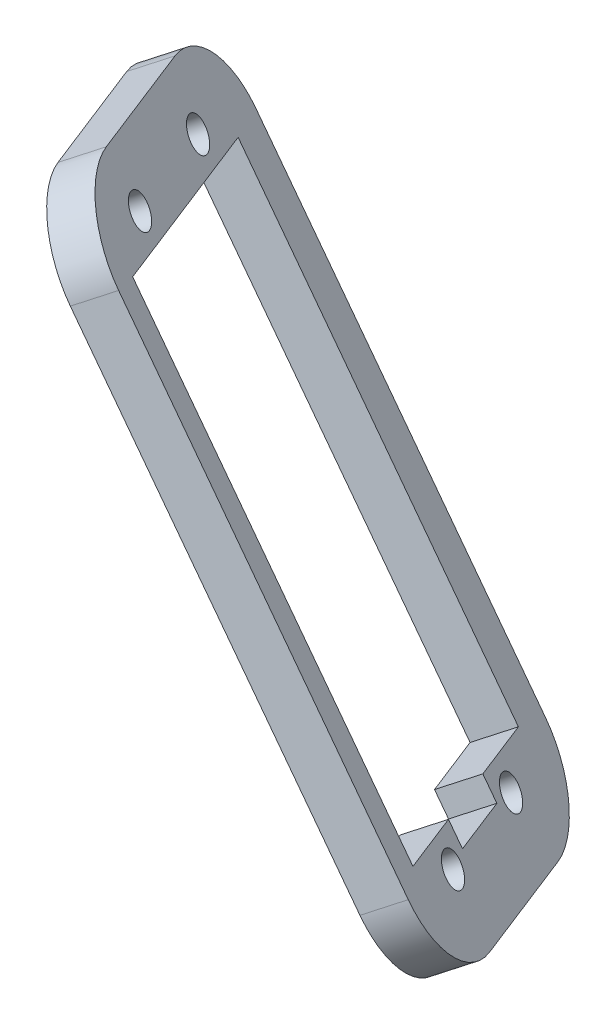
ISO-10303-21;
HEADER;
FILE_DESCRIPTION(('STEP AP214'),'2;1');
FILE_NAME('part.step','',(''),(''),'','','');
FILE_SCHEMA(('AUTOMOTIVE_DESIGN { 1 0 10303 214 1 1 1 1 }'));
ENDSEC;
DATA;
#1=APPLICATION_CONTEXT('core data for automotive mechanical design processes');
#2=APPLICATION_PROTOCOL_DEFINITION('international standard','automotive_design',2000,#1);
#3=PRODUCT_CONTEXT('',#1,'mechanical');
#4=PRODUCT('Part','Part','',(#3));
#5=PRODUCT_RELATED_PRODUCT_CATEGORY('part','',(#4));
#6=PRODUCT_DEFINITION_FORMATION('','',#4);
#7=PRODUCT_DEFINITION_CONTEXT('part definition',#1,'design');
#8=PRODUCT_DEFINITION('design','',#6,#7);
#9=PRODUCT_DEFINITION_SHAPE('','',#8);
#10=(LENGTH_UNIT() NAMED_UNIT(*) SI_UNIT(.MILLI.,.METRE.));
#11=(NAMED_UNIT(*) PLANE_ANGLE_UNIT() SI_UNIT($,.RADIAN.));
#12=(NAMED_UNIT(*) SI_UNIT($,.STERADIAN.) SOLID_ANGLE_UNIT());
#13=UNCERTAINTY_MEASURE_WITH_UNIT(LENGTH_MEASURE(1.E-05),#10,'distance_accuracy_value','');
#14=(GEOMETRIC_REPRESENTATION_CONTEXT(3) GLOBAL_UNCERTAINTY_ASSIGNED_CONTEXT((#13)) GLOBAL_UNIT_ASSIGNED_CONTEXT((#10,
#11,#12)) REPRESENTATION_CONTEXT('',''));
#15=CARTESIAN_POINT('',(0.,0.,0.));
#16=DIRECTION('',(0.,0.,1.));
#17=DIRECTION('',(1.,0.,0.));
#18=AXIS2_PLACEMENT_3D('',#15,#16,#17);
#19=CARTESIAN_POINT('',(-138.045703083911,-88.6474649306126,87.3415979869033));
#20=DIRECTION('',(-0.742744505062538,-0.476961006348122,0.469934887641673));
#21=DIRECTION('',(0.540342609409855,-0.841445104838188,0.));
#22=AXIS2_PLACEMENT_3D('',#19,#20,#21);
#23=PLANE('',#22);
#24=CARTESIAN_POINT('',(-338.360143592389,-143.155779393654,-284.583949763132));
#25=DIRECTION('',(-0.742744505062538,-0.476961006348123,0.469934887641673));
#26=DIRECTION('',(0.540342609409855,-0.841445104838188,0.));
#27=AXIS2_PLACEMENT_3D('',#24,#25,#26);
#28=CIRCLE('',#27,2.00000000000084);
#29=CARTESIAN_POINT('',(-337.279458373569,-144.838669603331,-284.583949763132));
#30=VERTEX_POINT('',#29);
#31=EDGE_CURVE('E255',#30,#30,#28,.T.);
#32=ORIENTED_EDGE('',*,*,#31,.F.);
#33=EDGE_LOOP('',(#32));
#34=FACE_BOUND('',#33,.T.);
#35=CARTESIAN_POINT('',(-345.918600174185,-146.010321717763,-299.42751140517));
#36=DIRECTION('',(-0.742744505062538,-0.476961006348123,0.469934887641673));
#37=DIRECTION('',(0.540342609409855,-0.841445104838188,0.));
#38=AXIS2_PLACEMENT_3D('',#35,#36,#37);
#39=CIRCLE('',#38,2.00000000000075);
#40=CARTESIAN_POINT('',(-344.837914955365,-147.69321192744,-299.42751140517));
#41=VERTEX_POINT('',#40);
#42=EDGE_CURVE('E251',#41,#41,#39,.T.);
#43=ORIENTED_EDGE('',*,*,#42,.F.);
#44=EDGE_LOOP('',(#43));
#45=FACE_BOUND('',#44,.T.);
#46=CARTESIAN_POINT('',(-304.974126351562,-200.946079477046,-290.470805381088));
#47=DIRECTION('',(-0.742744505062538,-0.476961006348123,0.469934887641673));
#48=DIRECTION('',(0.540342609409855,-0.841445104838188,0.));
#49=AXIS2_PLACEMENT_3D('',#46,#47,#48);
#50=CIRCLE('',#49,2.00000000000083);
#51=CARTESIAN_POINT('',(-303.893441132741,-202.628969686723,-290.470805381088));
#52=VERTEX_POINT('',#51);
#53=EDGE_CURVE('E247',#52,#52,#50,.T.);
#54=ORIENTED_EDGE('',*,*,#53,.F.);
#55=EDGE_LOOP('',(#54));
#56=FACE_BOUND('',#55,.T.);
#57=CARTESIAN_POINT('',(-312.532582933358,-203.800621801155,-305.314367023125));
#58=DIRECTION('',(-0.742744505062538,-0.476961006348123,0.469934887641673));
#59=DIRECTION('',(0.540342609409855,-0.841445104838188,0.));
#60=AXIS2_PLACEMENT_3D('',#57,#58,#59);
#61=CIRCLE('',#60,2.00000000000088);
#62=CARTESIAN_POINT('',(-311.451897714538,-205.483512010832,-305.314367023125));
#63=VERTEX_POINT('',#62);
#64=EDGE_CURVE('E243',#63,#63,#61,.T.);
#65=ORIENTED_EDGE('',*,*,#64,.F.);
#66=EDGE_LOOP('',(#65));
#67=FACE_BOUND('',#66,.T.);
#68=DIRECTION('',(0.447245951585577,0.168907829828928,0.878317256925306));
#69=VECTOR('',#68,1.);
#70=CARTESIAN_POINT('',(-314.054798329728,-212.986455291561,-317.043441947881));
#71=LINE('',#70,#69);
#72=CARTESIAN_POINT('',(-309.582338813872,-211.297376993272,-308.260269378628));
#73=VERTEX_POINT('',#72);
#74=CARTESIAN_POINT('',(-300.637419782161,-207.919220396693,-290.693924240122));
#75=VERTEX_POINT('',#74);
#76=EDGE_CURVE('E223',#73,#75,#71,.T.);
#77=ORIENTED_EDGE('',*,*,#76,.T.);
#78=CARTESIAN_POINT('',(-305.620407430045,-199.293802473799,-289.815289073263));
#79=DIRECTION('',(-0.742744505062538,-0.476961006348122,0.469934887641673));
#80=DIRECTION('',(0.540342609409855,-0.841445104838188,0.));
#81=AXIS2_PLACEMENT_3D('',#78,#79,#80);
#82=CIRCLE('',#81,10.);
#83=CARTESIAN_POINT('',(-301.14794791419,-197.60472417551,-281.03211650401));
#84=VERTEX_POINT('',#83);
#85=EDGE_CURVE('E278',#75,#84,#82,.T.);
#86=ORIENTED_EDGE('',*,*,#85,.T.);
#87=DIRECTION('',(-0.498298764788472,0.862541792289434,0.087863516685906));
#88=VECTOR('',#87,1.);
#89=CARTESIAN_POINT('',(-337.025458978959,-135.50171513067,-274.705943302625));
#90=LINE('',#89,#88);
#91=CARTESIAN_POINT('',(-332.042471331075,-144.127133053565,-275.584578469484));
#92=VERTEX_POINT('',#91);
#93=EDGE_CURVE('E227',#84,#92,#90,.T.);
#94=ORIENTED_EDGE('',*,*,#93,.T.);
#95=CARTESIAN_POINT('',(-336.51493084693,-145.816211351854,-284.367751038737));
#96=DIRECTION('',(-0.742744505062538,-0.476961006348122,0.469934887641673));
#97=DIRECTION('',(0.540342609409855,-0.841445104838188,0.));
#98=AXIS2_PLACEMENT_3D('',#95,#96,#97);
#99=CIRCLE('',#98,10.);
#100=CARTESIAN_POINT('',(-341.497918494815,-137.19079342896,-283.489115871878));
#101=VERTEX_POINT('',#100);
#102=EDGE_CURVE('E54',#92,#101,#99,.T.);
#103=ORIENTED_EDGE('',*,*,#102,.T.);
#104=DIRECTION('',(-0.447245951585578,-0.168907829828928,-0.878317256925305));
#105=VECTOR('',#104,1.);
#106=CARTESIAN_POINT('',(-354.915297042383,-142.258028323828,-309.838633579637));
#107=LINE('',#106,#105);
#108=CARTESIAN_POINT('',(-350.442837526527,-140.568950025538,-301.055461010384));
#109=VERTEX_POINT('',#108);
#110=EDGE_CURVE('E229',#101,#109,#107,.T.);
#111=ORIENTED_EDGE('',*,*,#110,.T.);
#112=CARTESIAN_POINT('',(-345.459849878642,-149.194367948433,-301.934096177243));
#113=DIRECTION('',(-0.742744505062538,-0.476961006348122,0.469934887641673));
#114=DIRECTION('',(0.540342609409855,-0.841445104838188,0.));
#115=AXIS2_PLACEMENT_3D('',#112,#113,#114);
#116=CIRCLE('',#115,10.);
#117=CARTESIAN_POINT('',(-349.932309394498,-150.883446246722,-310.717268746496));
#118=VERTEX_POINT('',#117);
#119=EDGE_CURVE('E273',#109,#118,#116,.T.);
#120=ORIENTED_EDGE('',*,*,#119,.T.);
#121=DIRECTION('',(0.498298764788472,-0.862541792289434,-0.087863516685906));
#122=VECTOR('',#121,1.);
#123=CARTESIAN_POINT('',(-354.915297042383,-142.258028323828,-309.838633579637));
#124=LINE('',#123,#122);
#125=CARTESIAN_POINT('',(-319.037785977613,-204.361037368667,-316.164806781022));
#126=VERTEX_POINT('',#125);
#127=EDGE_CURVE('E220',#118,#126,#124,.T.);
#128=ORIENTED_EDGE('',*,*,#127,.T.);
#129=CARTESIAN_POINT('',(-314.565326461757,-202.671959070377,-307.381634211769));
#130=DIRECTION('',(-0.742744505062538,-0.476961006348122,0.469934887641673));
#131=DIRECTION('',(0.540342609409855,-0.841445104838188,0.));
#132=AXIS2_PLACEMENT_3D('',#129,#130,#131);
#133=CIRCLE('',#132,10.);
#134=EDGE_CURVE('E276',#126,#73,#133,.T.);
#135=ORIENTED_EDGE('',*,*,#134,.T.);
#136=EDGE_LOOP('',(#77,#86,#94,#103,#111,#120,#128,#135));
#137=FACE_BOUND('',#136,.T.);
#138=DIRECTION('',(0.498298764788472,-0.862541792289434,-0.0878635166859052));
#139=VECTOR('',#138,1.);
#140=CARTESIAN_POINT('',(-317.362625676057,-201.947189553961,-311.067233787508));
#141=LINE('',#140,#139);
#142=CARTESIAN_POINT('',(-347.260551563365,-150.194682016595,-305.795422786354));
#143=VERTEX_POINT('',#142);
#144=CARTESIAN_POINT('',(-317.362625676057,-201.947189553961,-311.067233787508));
#145=VERTEX_POINT('',#144);
#146=EDGE_CURVE('E158',#143,#145,#141,.T.);
#147=ORIENTED_EDGE('',*,*,#146,.F.);
#148=DIRECTION('',(-0.447245951585576,-0.168907829828928,-0.878317256925306));
#149=VECTOR('',#148,1.);
#150=CARTESIAN_POINT('',(-347.260551563365,-150.194682016595,-305.795422786354));
#151=LINE('',#150,#149);
#152=CARTESIAN_POINT('',(-333.530100849688,-145.009211640847,-278.831082998747));
#153=VERTEX_POINT('',#152);
#154=EDGE_CURVE('E148',#153,#143,#151,.T.);
#155=ORIENTED_EDGE('',*,*,#154,.F.);
#156=DIRECTION('',(-0.498298764788472,0.862541792289434,0.0878635166859062));
#157=VECTOR('',#156,1.);
#158=CARTESIAN_POINT('',(-303.63217496238,-196.761719178213,-284.102893999901));
#159=LINE('',#158,#157);
#160=CARTESIAN_POINT('',(-303.63217496238,-196.761719178213,-284.102893999901));
#161=VERTEX_POINT('',#160);
#162=EDGE_CURVE('E185',#161,#153,#159,.T.);
#163=ORIENTED_EDGE('',*,*,#162,.F.);
#164=DIRECTION('',(0.447245951585577,0.168907829828926,0.878317256925306));
#165=VECTOR('',#164,1.);
#166=CARTESIAN_POINT('',(-308.261170561291,-198.509915216943,-293.193477609078));
#167=LINE('',#166,#165);
#168=CARTESIAN_POINT('',(-308.261170561291,-198.509915216943,-293.193477609078));
#169=VERTEX_POINT('',#168);
#170=EDGE_CURVE('E182',#169,#161,#167,.T.);
#171=ORIENTED_EDGE('',*,*,#170,.F.);
#172=DIRECTION('',(-0.498298764788479,0.862541792289428,0.0878635166859187));
#173=VECTOR('',#172,1.);
#174=CARTESIAN_POINT('',(-308.261170561291,-198.509915216943,-293.193477609078));
#175=LINE('',#174,#173);
#176=CARTESIAN_POINT('',(-306.766274266925,-201.097540593811,-293.457068159136));
#177=VERTEX_POINT('',#176);
#178=EDGE_CURVE('E180',#177,#169,#175,.T.);
#179=ORIENTED_EDGE('',*,*,#178,.F.);
#180=DIRECTION('',(0.447245951585579,0.168907829828929,0.878317256925305));
#181=VECTOR('',#180,1.);
#182=CARTESIAN_POINT('',(-311.238733782781,-202.7866188921,-302.240240728389));
#183=LINE('',#182,#181);
#184=CARTESIAN_POINT('',(-311.238733782781,-202.7866188921,-302.240240728389));
#185=VERTEX_POINT('',#184);
#186=EDGE_CURVE('E178',#185,#177,#183,.T.);
#187=ORIENTED_EDGE('',*,*,#186,.F.);
#188=DIRECTION('',(0.498298764788466,-0.862541792289438,-0.0878635166859012));
#189=VECTOR('',#188,1.);
#190=CARTESIAN_POINT('',(-312.733630077146,-200.198993515232,-301.976650178331));
#191=LINE('',#190,#189);
#192=CARTESIAN_POINT('',(-312.733630077146,-200.198993515232,-301.976650178331));
#193=VERTEX_POINT('',#192);
#194=EDGE_CURVE('E173',#193,#185,#191,.T.);
#195=ORIENTED_EDGE('',*,*,#194,.F.);
#196=DIRECTION('',(0.447245951585579,0.16890782982893,0.878317256925304));
#197=VECTOR('',#196,1.);
#198=CARTESIAN_POINT('',(-317.362625676057,-201.947189553961,-311.067233787508));
#199=LINE('',#198,#197);
#200=EDGE_CURVE('E171',#145,#193,#199,.T.);
#201=ORIENTED_EDGE('',*,*,#200,.F.);
#202=EDGE_LOOP('',(#147,#155,#163,#171,#179,#187,#195,#201));
#203=FACE_BOUND('',#202,.T.);
#204=ADVANCED_FACE('F33',(#34,#45,#56,#67,#137,#203),#23,.T.);
#205=CARTESIAN_POINT('',(-134.331980558599,-86.2626598988719,84.991923548695));
#206=DIRECTION('',(-0.742744505062538,-0.476961006348122,0.469934887641673));
#207=DIRECTION('',(0.540342609409855,-0.841445104838188,0.));
#208=AXIS2_PLACEMENT_3D('',#205,#206,#207);
#209=PLANE('',#208);
#210=CARTESIAN_POINT('',(-334.646421067076,-140.770974361913,-286.93362420134));
#211=DIRECTION('',(-0.742744505062538,-0.476961006348122,0.469934887641673));
#212=DIRECTION('',(0.540342609409855,-0.841445104838188,0.));
#213=AXIS2_PLACEMENT_3D('',#210,#211,#212);
#214=CIRCLE('',#213,2.00000000000084);
#215=CARTESIAN_POINT('',(-333.565735848256,-142.45386457159,-286.93362420134));
#216=VERTEX_POINT('',#215);
#217=EDGE_CURVE('E252',#216,#216,#214,.T.);
#218=ORIENTED_EDGE('',*,*,#217,.T.);
#219=EDGE_LOOP('',(#218));
#220=FACE_BOUND('',#219,.T.);
#221=CARTESIAN_POINT('',(-342.204877648873,-143.625516686022,-301.777185843378));
#222=DIRECTION('',(-0.742744505062538,-0.476961006348122,0.469934887641673));
#223=DIRECTION('',(0.540342609409855,-0.841445104838188,0.));
#224=AXIS2_PLACEMENT_3D('',#221,#222,#223);
#225=CIRCLE('',#224,2.00000000000075);
#226=CARTESIAN_POINT('',(-341.124192430053,-145.308406895699,-301.777185843378));
#227=VERTEX_POINT('',#226);
#228=EDGE_CURVE('E248',#227,#227,#225,.T.);
#229=ORIENTED_EDGE('',*,*,#228,.T.);
#230=EDGE_LOOP('',(#229));
#231=FACE_BOUND('',#230,.T.);
#232=CARTESIAN_POINT('',(-301.260403826249,-198.561274445305,-292.820479819296));
#233=DIRECTION('',(-0.742744505062538,-0.476961006348122,0.469934887641673));
#234=DIRECTION('',(0.540342609409855,-0.841445104838188,0.));
#235=AXIS2_PLACEMENT_3D('',#232,#233,#234);
#236=CIRCLE('',#235,2.00000000000083);
#237=CARTESIAN_POINT('',(-300.179718607429,-200.244164654982,-292.820479819296));
#238=VERTEX_POINT('',#237);
#239=EDGE_CURVE('E244',#238,#238,#236,.T.);
#240=ORIENTED_EDGE('',*,*,#239,.T.);
#241=EDGE_LOOP('',(#240));
#242=FACE_BOUND('',#241,.T.);
#243=CARTESIAN_POINT('',(-308.818860408045,-201.415816769414,-307.664041461334));
#244=DIRECTION('',(-0.742744505062538,-0.476961006348122,0.469934887641673));
#245=DIRECTION('',(0.540342609409855,-0.841445104838188,0.));
#246=AXIS2_PLACEMENT_3D('',#243,#244,#245);
#247=CIRCLE('',#246,2.00000000000088);
#248=CARTESIAN_POINT('',(-307.738175189225,-203.098706979091,-307.664041461334));
#249=VERTEX_POINT('',#248);
#250=EDGE_CURVE('E189',#249,#249,#247,.T.);
#251=ORIENTED_EDGE('',*,*,#250,.T.);
#252=EDGE_LOOP('',(#251));
#253=FACE_BOUND('',#252,.T.);
#254=DIRECTION('',(-0.498298764788472,0.862541792289434,0.087863516685906));
#255=VECTOR('',#254,1.);
#256=CARTESIAN_POINT('',(-333.311736453647,-133.11691009893,-277.055617740833));
#257=LINE('',#256,#255);
#258=CARTESIAN_POINT('',(-297.434225388877,-195.219919143769,-283.381790942218));
#259=VERTEX_POINT('',#258);
#260=CARTESIAN_POINT('',(-328.328748805762,-141.742328021824,-277.934252907692));
#261=VERTEX_POINT('',#260);
#262=EDGE_CURVE('E237',#259,#261,#257,.T.);
#263=ORIENTED_EDGE('',*,*,#262,.F.);
#264=CARTESIAN_POINT('',(-301.906684904733,-196.908997442058,-292.164963511471));
#265=DIRECTION('',(-0.742744505062538,-0.476961006348122,0.469934887641673));
#266=DIRECTION('',(0.540342609409855,-0.841445104838188,0.));
#267=AXIS2_PLACEMENT_3D('',#264,#265,#266);
#268=CIRCLE('',#267,10.);
#269=CARTESIAN_POINT('',(-296.923697256848,-205.534415364953,-293.04359867833));
#270=VERTEX_POINT('',#269);
#271=EDGE_CURVE('E266',#259,#270,#268,.F.);
#272=ORIENTED_EDGE('',*,*,#271,.T.);
#273=DIRECTION('',(0.447245951585577,0.168907829828928,0.878317256925306));
#274=VECTOR('',#273,1.);
#275=CARTESIAN_POINT('',(-310.341075804415,-210.60165025982,-319.39311638609));
#276=LINE('',#275,#274);
#277=CARTESIAN_POINT('',(-305.868616288559,-208.912571961531,-310.609943816837));
#278=VERTEX_POINT('',#277);
#279=EDGE_CURVE('E234',#278,#270,#276,.T.);
#280=ORIENTED_EDGE('',*,*,#279,.F.);
#281=CARTESIAN_POINT('',(-310.851603936444,-200.287154038637,-309.731308649978));
#282=DIRECTION('',(-0.742744505062538,-0.476961006348122,0.469934887641673));
#283=DIRECTION('',(0.540342609409855,-0.841445104838188,0.));
#284=AXIS2_PLACEMENT_3D('',#281,#282,#283);
#285=CIRCLE('',#284,10.);
#286=CARTESIAN_POINT('',(-315.3240634523,-201.976232336926,-318.514481219231));
#287=VERTEX_POINT('',#286);
#288=EDGE_CURVE('E264',#278,#287,#285,.F.);
#289=ORIENTED_EDGE('',*,*,#288,.T.);
#290=DIRECTION('',(0.498298764788472,-0.862541792289434,-0.087863516685906));
#291=VECTOR('',#290,1.);
#292=CARTESIAN_POINT('',(-351.20157451707,-139.873223292087,-312.188308017845));
#293=LINE('',#292,#291);
#294=CARTESIAN_POINT('',(-346.218586869185,-148.498641214981,-313.066943184704));
#295=VERTEX_POINT('',#294);
#296=EDGE_CURVE('E166',#295,#287,#293,.T.);
#297=ORIENTED_EDGE('',*,*,#296,.F.);
#298=CARTESIAN_POINT('',(-341.746127353329,-146.809562916692,-304.283770615451));
#299=DIRECTION('',(-0.742744505062538,-0.476961006348122,0.469934887641673));
#300=DIRECTION('',(0.540342609409855,-0.841445104838188,0.));
#301=AXIS2_PLACEMENT_3D('',#298,#299,#300);
#302=CIRCLE('',#301,10.);
#303=CARTESIAN_POINT('',(-346.729115001214,-138.184144993798,-303.405135448592));
#304=VERTEX_POINT('',#303);
#305=EDGE_CURVE('E260',#295,#304,#302,.F.);
#306=ORIENTED_EDGE('',*,*,#305,.T.);
#307=DIRECTION('',(-0.447245951585578,-0.168907829828928,-0.878317256925305));
#308=VECTOR('',#307,1.);
#309=CARTESIAN_POINT('',(-351.20157451707,-139.873223292087,-312.188308017845));
#310=LINE('',#309,#308);
#311=CARTESIAN_POINT('',(-337.784195969502,-134.805988397219,-285.838790310086));
#312=VERTEX_POINT('',#311);
#313=EDGE_CURVE('E224',#312,#304,#310,.T.);
#314=ORIENTED_EDGE('',*,*,#313,.F.);
#315=CARTESIAN_POINT('',(-332.801208321618,-143.431406320113,-286.717425476945));
#316=DIRECTION('',(-0.742744505062538,-0.476961006348122,0.469934887641673));
#317=DIRECTION('',(0.540342609409855,-0.841445104838188,0.));
#318=AXIS2_PLACEMENT_3D('',#315,#316,#317);
#319=CIRCLE('',#318,10.);
#320=EDGE_CURVE('E262',#312,#261,#319,.F.);
#321=ORIENTED_EDGE('',*,*,#320,.T.);
#322=EDGE_LOOP('',(#263,#272,#280,#289,#297,#306,#314,#321));
#323=FACE_BOUND('',#322,.T.);
#324=DIRECTION('',(-0.447245951585576,-0.168907829828928,-0.878317256925306));
#325=VECTOR('',#324,1.);
#326=CARTESIAN_POINT('',(-343.546829038053,-147.809876984855,-308.145097224562));
#327=LINE('',#326,#325);
#328=CARTESIAN_POINT('',(-329.816378324376,-142.624406609107,-281.180757436955));
#329=VERTEX_POINT('',#328);
#330=CARTESIAN_POINT('',(-343.546829038053,-147.809876984855,-308.145097224562));
#331=VERTEX_POINT('',#330);
#332=EDGE_CURVE('E187',#329,#331,#327,.T.);
#333=ORIENTED_EDGE('',*,*,#332,.T.);
#334=DIRECTION('',(0.498298764788472,-0.862541792289434,-0.0878635166859052));
#335=VECTOR('',#334,1.);
#336=CARTESIAN_POINT('',(-313.648903150744,-199.562384522221,-313.416908225717));
#337=LINE('',#336,#335);
#338=CARTESIAN_POINT('',(-313.648903150744,-199.562384522221,-313.416908225717));
#339=VERTEX_POINT('',#338);
#340=EDGE_CURVE('E165',#331,#339,#337,.T.);
#341=ORIENTED_EDGE('',*,*,#340,.T.);
#342=DIRECTION('',(0.447245951585579,0.16890782982893,0.878317256925304));
#343=VECTOR('',#342,1.);
#344=CARTESIAN_POINT('',(-313.648903150744,-199.562384522221,-313.416908225717));
#345=LINE('',#344,#343);
#346=CARTESIAN_POINT('',(-309.019907551834,-197.814188483491,-304.32632461654));
#347=VERTEX_POINT('',#346);
#348=EDGE_CURVE('E191',#339,#347,#345,.T.);
#349=ORIENTED_EDGE('',*,*,#348,.T.);
#350=DIRECTION('',(0.498298764788466,-0.862541792289438,-0.0878635166859012));
#351=VECTOR('',#350,1.);
#352=CARTESIAN_POINT('',(-309.019907551834,-197.814188483491,-304.32632461654));
#353=LINE('',#352,#351);
#354=CARTESIAN_POINT('',(-307.525011257468,-200.40181386036,-304.589915166597));
#355=VERTEX_POINT('',#354);
#356=EDGE_CURVE('E194',#347,#355,#353,.T.);
#357=ORIENTED_EDGE('',*,*,#356,.T.);
#358=DIRECTION('',(0.447245951585579,0.168907829828929,0.878317256925305));
#359=VECTOR('',#358,1.);
#360=CARTESIAN_POINT('',(-307.525011257468,-200.40181386036,-304.589915166597));
#361=LINE('',#360,#359);
#362=CARTESIAN_POINT('',(-303.052551741613,-198.71273556207,-295.806742597344));
#363=VERTEX_POINT('',#362);
#364=EDGE_CURVE('E197',#355,#363,#361,.T.);
#365=ORIENTED_EDGE('',*,*,#364,.T.);
#366=DIRECTION('',(-0.498298764788479,0.862541792289428,0.0878635166859187));
#367=VECTOR('',#366,1.);
#368=CARTESIAN_POINT('',(-304.547448035978,-196.125110185202,-295.543152047287));
#369=LINE('',#368,#367);
#370=CARTESIAN_POINT('',(-304.547448035978,-196.125110185202,-295.543152047287));
#371=VERTEX_POINT('',#370);
#372=EDGE_CURVE('E200',#363,#371,#369,.T.);
#373=ORIENTED_EDGE('',*,*,#372,.T.);
#374=DIRECTION('',(0.447245951585577,0.168907829828926,0.878317256925306));
#375=VECTOR('',#374,1.);
#376=CARTESIAN_POINT('',(-304.547448035978,-196.125110185202,-295.543152047287));
#377=LINE('',#376,#375);
#378=CARTESIAN_POINT('',(-299.918452437067,-194.376914146473,-286.45256843811));
#379=VERTEX_POINT('',#378);
#380=EDGE_CURVE('E203',#371,#379,#377,.T.);
#381=ORIENTED_EDGE('',*,*,#380,.T.);
#382=DIRECTION('',(-0.498298764788472,0.862541792289434,0.0878635166859062));
#383=VECTOR('',#382,1.);
#384=CARTESIAN_POINT('',(-299.918452437067,-194.376914146473,-286.45256843811));
#385=LINE('',#384,#383);
#386=EDGE_CURVE('E159',#379,#329,#385,.T.);
#387=ORIENTED_EDGE('',*,*,#386,.T.);
#388=EDGE_LOOP('',(#333,#341,#349,#357,#365,#373,#381,#387));
#389=FACE_BOUND('',#388,.T.);
#390=ADVANCED_FACE('F302',(#220,#231,#242,#253,#323,#389),#209,.F.);
#391=CARTESIAN_POINT('',(-354.915297042383,-142.258028323828,-309.838633579637));
#392=DIRECTION('',(0.447245951585577,0.168907829828928,0.878317256925306));
#393=DIRECTION('',(0.891121016780283,0.,-0.453765725294976));
#394=AXIS2_PLACEMENT_3D('',#391,#392,#393);
#395=PLANE('',#394);
#396=ORIENTED_EDGE('',*,*,#296,.T.);
#397=DIRECTION('',(0.742744505062538,0.476961006348122,-0.469934887641673));
#398=VECTOR('',#397,1.);
#399=CARTESIAN_POINT('',(-319.037785977613,-204.361037368667,-316.164806781022));
#400=LINE('',#399,#398);
#401=EDGE_CURVE('E283',#287,#126,#400,.F.);
#402=ORIENTED_EDGE('',*,*,#401,.T.);
#403=ORIENTED_EDGE('',*,*,#127,.F.);
#404=DIRECTION('',(0.742744505062538,0.476961006348122,-0.469934887641673));
#405=VECTOR('',#404,1.);
#406=CARTESIAN_POINT('',(-349.932309394498,-150.883446246722,-310.717268746496));
#407=LINE('',#406,#405);
#408=EDGE_CURVE('E280',#118,#295,#407,.T.);
#409=ORIENTED_EDGE('',*,*,#408,.T.);
#410=EDGE_LOOP('',(#396,#402,#403,#409));
#411=FACE_BOUND('',#410,.T.);
#412=ADVANCED_FACE('F287',(#411),#395,.F.);
#413=CARTESIAN_POINT('',(-314.054798329728,-212.986455291561,-317.043441947881));
#414=DIRECTION('',(-0.498298764788472,0.862541792289434,0.087863516685906));
#415=DIRECTION('',(-0.865890604697365,-0.500233406218369,0.));
#416=AXIS2_PLACEMENT_3D('',#413,#414,#415);
#417=PLANE('',#416);
#418=ORIENTED_EDGE('',*,*,#279,.T.);
#419=DIRECTION('',(0.742744505062538,0.476961006348122,-0.469934887641673));
#420=VECTOR('',#419,1.);
#421=CARTESIAN_POINT('',(-300.637419782161,-207.919220396693,-290.693924240122));
#422=LINE('',#421,#420);
#423=EDGE_CURVE('E271',#270,#75,#422,.F.);
#424=ORIENTED_EDGE('',*,*,#423,.T.);
#425=ORIENTED_EDGE('',*,*,#76,.F.);
#426=DIRECTION('',(0.742744505062538,0.476961006348122,-0.469934887641673));
#427=VECTOR('',#426,1.);
#428=CARTESIAN_POINT('',(-309.582338813872,-211.297376993272,-308.260269378628));
#429=LINE('',#428,#427);
#430=EDGE_CURVE('E268',#73,#278,#429,.T.);
#431=ORIENTED_EDGE('',*,*,#430,.T.);
#432=EDGE_LOOP('',(#418,#424,#425,#431));
#433=FACE_BOUND('',#432,.T.);
#434=ADVANCED_FACE('F298',(#433),#417,.F.);
#435=CARTESIAN_POINT('',(-337.025458978959,-135.50171513067,-274.705943302625));
#436=DIRECTION('',(-0.447245951585578,-0.168907829828928,-0.878317256925306));
#437=DIRECTION('',(-0.891121016780283,0.,0.453765725294976));
#438=AXIS2_PLACEMENT_3D('',#435,#436,#437);
#439=PLANE('',#438);
#440=ORIENTED_EDGE('',*,*,#93,.F.);
#441=DIRECTION('',(0.742744505062538,0.476961006348122,-0.469934887641673));
#442=VECTOR('',#441,1.);
#443=CARTESIAN_POINT('',(-301.14794791419,-197.60472417551,-281.03211650401));
#444=LINE('',#443,#442);
#445=EDGE_CURVE('E257',#84,#259,#444,.T.);
#446=ORIENTED_EDGE('',*,*,#445,.T.);
#447=ORIENTED_EDGE('',*,*,#262,.T.);
#448=DIRECTION('',(0.742744505062538,0.476961006348122,-0.469934887641673));
#449=VECTOR('',#448,1.);
#450=CARTESIAN_POINT('',(-332.042471331075,-144.127133053565,-275.584578469484));
#451=LINE('',#450,#449);
#452=EDGE_CURVE('E231',#261,#92,#451,.F.);
#453=ORIENTED_EDGE('',*,*,#452,.T.);
#454=EDGE_LOOP('',(#440,#446,#447,#453));
#455=FACE_BOUND('',#454,.T.);
#456=ADVANCED_FACE('F310',(#455),#439,.F.);
#457=CARTESIAN_POINT('',(-354.915297042383,-142.258028323828,-309.838633579637));
#458=DIRECTION('',(0.498298764788472,-0.862541792289434,-0.0878635166859066));
#459=DIRECTION('',(0.865890604697365,0.500233406218369,0.));
#460=AXIS2_PLACEMENT_3D('',#457,#458,#459);
#461=PLANE('',#460);
#462=ORIENTED_EDGE('',*,*,#110,.F.);
#463=DIRECTION('',(0.742744505062538,0.476961006348122,-0.469934887641673));
#464=VECTOR('',#463,1.);
#465=CARTESIAN_POINT('',(-341.497918494815,-137.19079342896,-283.489115871878));
#466=LINE('',#465,#464);
#467=EDGE_CURVE('E11',#101,#312,#466,.T.);
#468=ORIENTED_EDGE('',*,*,#467,.T.);
#469=ORIENTED_EDGE('',*,*,#313,.T.);
#470=DIRECTION('',(0.742744505062538,0.476961006348122,-0.469934887641673));
#471=VECTOR('',#470,1.);
#472=CARTESIAN_POINT('',(-350.442837526527,-140.568950025538,-301.055461010384));
#473=LINE('',#472,#471);
#474=EDGE_CURVE('E41',#304,#109,#473,.F.);
#475=ORIENTED_EDGE('',*,*,#474,.T.);
#476=EDGE_LOOP('',(#462,#468,#469,#475));
#477=FACE_BOUND('',#476,.T.);
#478=ADVANCED_FACE('F316',(#477),#461,.F.);
#479=CARTESIAN_POINT('',(-347.260551563365,-150.194682016595,-305.795422786354));
#480=DIRECTION('',(0.498298764788473,-0.862541792289434,-0.0878635166859051));
#481=DIRECTION('',(0.865890604697365,0.500233406218369,0.));
#482=AXIS2_PLACEMENT_3D('',#479,#480,#481);
#483=PLANE('',#482);
#484=ORIENTED_EDGE('',*,*,#332,.F.);
#485=DIRECTION('',(0.742744505062538,0.476961006348122,-0.469934887641673));
#486=VECTOR('',#485,1.);
#487=CARTESIAN_POINT('',(-333.530100849688,-145.009211640847,-278.831082998747));
#488=LINE('',#487,#486);
#489=EDGE_CURVE('E154',#153,#329,#488,.T.);
#490=ORIENTED_EDGE('',*,*,#489,.F.);
#491=ORIENTED_EDGE('',*,*,#154,.T.);
#492=DIRECTION('',(0.742744505062538,0.476961006348122,-0.469934887641673));
#493=VECTOR('',#492,1.);
#494=CARTESIAN_POINT('',(-347.260551563365,-150.194682016595,-305.795422786354));
#495=LINE('',#494,#493);
#496=EDGE_CURVE('E151',#143,#331,#495,.T.);
#497=ORIENTED_EDGE('',*,*,#496,.T.);
#498=EDGE_LOOP('',(#484,#490,#491,#497));
#499=FACE_BOUND('',#498,.T.);
#500=ADVANCED_FACE('F150',(#499),#483,.T.);
#501=CARTESIAN_POINT('',(-317.362625676057,-201.947189553961,-311.067233787508));
#502=DIRECTION('',(0.447245951585577,0.168907829828929,0.878317256925306));
#503=DIRECTION('',(0.891121016780283,0.,-0.453765725294975));
#504=AXIS2_PLACEMENT_3D('',#501,#502,#503);
#505=PLANE('',#504);
#506=ORIENTED_EDGE('',*,*,#340,.F.);
#507=ORIENTED_EDGE('',*,*,#496,.F.);
#508=ORIENTED_EDGE('',*,*,#146,.T.);
#509=DIRECTION('',(0.742744505062538,0.476961006348122,-0.469934887641673));
#510=VECTOR('',#509,1.);
#511=CARTESIAN_POINT('',(-317.362625676057,-201.947189553961,-311.067233787508));
#512=LINE('',#511,#510);
#513=EDGE_CURVE('E167',#145,#339,#512,.T.);
#514=ORIENTED_EDGE('',*,*,#513,.T.);
#515=EDGE_LOOP('',(#506,#507,#508,#514));
#516=FACE_BOUND('',#515,.T.);
#517=ADVANCED_FACE('F162',(#516),#505,.T.);
#518=CARTESIAN_POINT('',(-317.362625676057,-201.947189553961,-311.067233787508));
#519=DIRECTION('',(-0.498298764788472,0.862541792289434,0.0878635166859055));
#520=DIRECTION('',(-0.865890604697365,-0.500233406218369,0.));
#521=AXIS2_PLACEMENT_3D('',#518,#519,#520);
#522=PLANE('',#521);
#523=ORIENTED_EDGE('',*,*,#348,.F.);
#524=ORIENTED_EDGE('',*,*,#513,.F.);
#525=ORIENTED_EDGE('',*,*,#200,.T.);
#526=DIRECTION('',(0.742744505062538,0.476961006348122,-0.469934887641673));
#527=VECTOR('',#526,1.);
#528=CARTESIAN_POINT('',(-312.733630077146,-200.198993515232,-301.976650178331));
#529=LINE('',#528,#527);
#530=EDGE_CURVE('E217',#193,#347,#529,.T.);
#531=ORIENTED_EDGE('',*,*,#530,.T.);
#532=EDGE_LOOP('',(#523,#524,#525,#531));
#533=FACE_BOUND('',#532,.T.);
#534=ADVANCED_FACE('F447',(#533),#522,.T.);
#535=CARTESIAN_POINT('',(-312.733630077146,-200.198993515232,-301.976650178331));
#536=DIRECTION('',(0.447245951585577,0.168907829828929,0.878317256925306));
#537=DIRECTION('',(0.891121016780283,0.,-0.453765725294975));
#538=AXIS2_PLACEMENT_3D('',#535,#536,#537);
#539=PLANE('',#538);
#540=ORIENTED_EDGE('',*,*,#356,.F.);
#541=ORIENTED_EDGE('',*,*,#530,.F.);
#542=ORIENTED_EDGE('',*,*,#194,.T.);
#543=DIRECTION('',(0.742744505062538,0.476961006348122,-0.469934887641673));
#544=VECTOR('',#543,1.);
#545=CARTESIAN_POINT('',(-311.238733782781,-202.7866188921,-302.240240728389));
#546=LINE('',#545,#544);
#547=EDGE_CURVE('E215',#185,#355,#546,.T.);
#548=ORIENTED_EDGE('',*,*,#547,.T.);
#549=EDGE_LOOP('',(#540,#541,#542,#548));
#550=FACE_BOUND('',#549,.T.);
#551=ADVANCED_FACE('F438',(#550),#539,.T.);
#552=CARTESIAN_POINT('',(-311.238733782781,-202.7866188921,-302.240240728389));
#553=DIRECTION('',(-0.498298764788472,0.862541792289434,0.0878635166859058));
#554=DIRECTION('',(-0.865890604697365,-0.500233406218369,0.));
#555=AXIS2_PLACEMENT_3D('',#552,#553,#554);
#556=PLANE('',#555);
#557=ORIENTED_EDGE('',*,*,#364,.F.);
#558=ORIENTED_EDGE('',*,*,#547,.F.);
#559=ORIENTED_EDGE('',*,*,#186,.T.);
#560=DIRECTION('',(0.742744505062538,0.476961006348122,-0.469934887641673));
#561=VECTOR('',#560,1.);
#562=CARTESIAN_POINT('',(-306.766274266925,-201.097540593811,-293.457068159136));
#563=LINE('',#562,#561);
#564=EDGE_CURVE('E213',#177,#363,#563,.T.);
#565=ORIENTED_EDGE('',*,*,#564,.T.);
#566=EDGE_LOOP('',(#557,#558,#559,#565));
#567=FACE_BOUND('',#566,.T.);
#568=ADVANCED_FACE('F429',(#567),#556,.T.);
#569=CARTESIAN_POINT('',(-308.261170561291,-198.509915216943,-293.193477609078));
#570=DIRECTION('',(-0.447245951585581,-0.168907829828922,-0.878317256925305));
#571=DIRECTION('',(-0.891121016780281,0.,0.453765725294979));
#572=AXIS2_PLACEMENT_3D('',#569,#570,#571);
#573=PLANE('',#572);
#574=ORIENTED_EDGE('',*,*,#372,.F.);
#575=ORIENTED_EDGE('',*,*,#564,.F.);
#576=ORIENTED_EDGE('',*,*,#178,.T.);
#577=DIRECTION('',(0.742744505062538,0.476961006348122,-0.469934887641673));
#578=VECTOR('',#577,1.);
#579=CARTESIAN_POINT('',(-308.261170561291,-198.509915216943,-293.193477609078));
#580=LINE('',#579,#578);
#581=EDGE_CURVE('E211',#169,#371,#580,.T.);
#582=ORIENTED_EDGE('',*,*,#581,.T.);
#583=EDGE_LOOP('',(#574,#575,#576,#582));
#584=FACE_BOUND('',#583,.T.);
#585=ADVANCED_FACE('F420',(#584),#573,.T.);
#586=CARTESIAN_POINT('',(-308.261170561291,-198.509915216943,-293.193477609078));
#587=DIRECTION('',(-0.498298764788472,0.862541792289434,0.0878635166859071));
#588=DIRECTION('',(-0.865890604697365,-0.500233406218368,0.));
#589=AXIS2_PLACEMENT_3D('',#586,#587,#588);
#590=PLANE('',#589);
#591=ORIENTED_EDGE('',*,*,#380,.F.);
#592=ORIENTED_EDGE('',*,*,#581,.F.);
#593=ORIENTED_EDGE('',*,*,#170,.T.);
#594=DIRECTION('',(0.742744505062538,0.476961006348122,-0.469934887641673));
#595=VECTOR('',#594,1.);
#596=CARTESIAN_POINT('',(-303.63217496238,-196.761719178213,-284.102893999901));
#597=LINE('',#596,#595);
#598=EDGE_CURVE('E209',#161,#379,#597,.T.);
#599=ORIENTED_EDGE('',*,*,#598,.T.);
#600=EDGE_LOOP('',(#591,#592,#593,#599));
#601=FACE_BOUND('',#600,.T.);
#602=ADVANCED_FACE('F411',(#601),#590,.T.);
#603=CARTESIAN_POINT('',(-303.63217496238,-196.761719178213,-284.102893999901));
#604=DIRECTION('',(-0.447245951585577,-0.168907829828928,-0.878317256925306));
#605=DIRECTION('',(-0.891121016780283,0.,0.453765725294976));
#606=AXIS2_PLACEMENT_3D('',#603,#604,#605);
#607=PLANE('',#606);
#608=ORIENTED_EDGE('',*,*,#386,.F.);
#609=ORIENTED_EDGE('',*,*,#598,.F.);
#610=ORIENTED_EDGE('',*,*,#162,.T.);
#611=ORIENTED_EDGE('',*,*,#489,.T.);
#612=EDGE_LOOP('',(#608,#609,#610,#611));
#613=FACE_BOUND('',#612,.T.);
#614=ADVANCED_FACE('F402',(#613),#607,.T.);
#615=CARTESIAN_POINT('',(-305.105137882732,-199.031011737673,-310.013715899542));
#616=DIRECTION('',(-0.742744505062538,-0.476961006348123,0.469934887641673));
#617=DIRECTION('',(0.540342609409856,-0.841445104838188,0.));
#618=AXIS2_PLACEMENT_3D('',#615,#616,#617);
#619=CYLINDRICAL_SURFACE('',#618,2.00000000000088);
#620=ORIENTED_EDGE('',*,*,#64,.T.);
#621=EDGE_LOOP('',(#620));
#622=FACE_BOUND('',#621,.T.);
#623=ORIENTED_EDGE('',*,*,#250,.F.);
#624=EDGE_LOOP('',(#623));
#625=FACE_BOUND('',#624,.T.);
#626=ADVANCED_FACE('F393',(#622,#625),#619,.F.);
#627=CARTESIAN_POINT('',(-297.546681300936,-196.176469413565,-295.170154257504));
#628=DIRECTION('',(-0.742744505062538,-0.476961006348123,0.469934887641673));
#629=DIRECTION('',(0.540342609409856,-0.841445104838188,0.));
#630=AXIS2_PLACEMENT_3D('',#627,#628,#629);
#631=CYLINDRICAL_SURFACE('',#630,2.00000000000083);
#632=ORIENTED_EDGE('',*,*,#53,.T.);
#633=EDGE_LOOP('',(#632));
#634=FACE_BOUND('',#633,.T.);
#635=ORIENTED_EDGE('',*,*,#239,.F.);
#636=EDGE_LOOP('',(#635));
#637=FACE_BOUND('',#636,.T.);
#638=ADVANCED_FACE('F384',(#634,#637),#631,.F.);
#639=CARTESIAN_POINT('',(-338.49115512356,-141.240711654281,-304.126860281586));
#640=DIRECTION('',(-0.742744505062538,-0.476961006348123,0.469934887641673));
#641=DIRECTION('',(0.540342609409856,-0.841445104838188,0.));
#642=AXIS2_PLACEMENT_3D('',#639,#640,#641);
#643=CYLINDRICAL_SURFACE('',#642,2.00000000000075);
#644=ORIENTED_EDGE('',*,*,#42,.T.);
#645=EDGE_LOOP('',(#644));
#646=FACE_BOUND('',#645,.T.);
#647=ORIENTED_EDGE('',*,*,#228,.F.);
#648=EDGE_LOOP('',(#647));
#649=FACE_BOUND('',#648,.T.);
#650=ADVANCED_FACE('F375',(#646,#649),#643,.F.);
#651=CARTESIAN_POINT('',(-330.932698541764,-138.386169330173,-289.283298639549));
#652=DIRECTION('',(-0.742744505062538,-0.476961006348123,0.469934887641673));
#653=DIRECTION('',(0.540342609409856,-0.841445104838188,0.));
#654=AXIS2_PLACEMENT_3D('',#651,#652,#653);
#655=CYLINDRICAL_SURFACE('',#654,2.00000000000084);
#656=ORIENTED_EDGE('',*,*,#31,.T.);
#657=EDGE_LOOP('',(#656));
#658=FACE_BOUND('',#657,.T.);
#659=ORIENTED_EDGE('',*,*,#217,.F.);
#660=EDGE_LOOP('',(#659));
#661=FACE_BOUND('',#660,.T.);
#662=ADVANCED_FACE('F346',(#658,#661),#655,.F.);
#663=CARTESIAN_POINT('',(-305.620407430045,-199.293802473799,-289.815289073263));
#664=DIRECTION('',(0.742744505062538,0.476961006348122,-0.469934887641673));
#665=DIRECTION('',(-0.540342609409855,0.841445104838188,0.));
#666=AXIS2_PLACEMENT_3D('',#663,#664,#665);
#667=CYLINDRICAL_SURFACE('',#666,10.);
#668=ORIENTED_EDGE('',*,*,#85,.F.);
#669=ORIENTED_EDGE('',*,*,#423,.F.);
#670=ORIENTED_EDGE('',*,*,#271,.F.);
#671=ORIENTED_EDGE('',*,*,#445,.F.);
#672=EDGE_LOOP('',(#668,#669,#670,#671));
#673=FACE_BOUND('',#672,.T.);
#674=ADVANCED_FACE('F307',(#673),#667,.T.);
#675=CARTESIAN_POINT('',(-314.565326461757,-202.671959070377,-307.381634211769));
#676=DIRECTION('',(0.742744505062538,0.476961006348122,-0.469934887641673));
#677=DIRECTION('',(-0.540342609409855,0.841445104838188,0.));
#678=AXIS2_PLACEMENT_3D('',#675,#676,#677);
#679=CYLINDRICAL_SURFACE('',#678,10.);
#680=ORIENTED_EDGE('',*,*,#134,.F.);
#681=ORIENTED_EDGE('',*,*,#401,.F.);
#682=ORIENTED_EDGE('',*,*,#288,.F.);
#683=ORIENTED_EDGE('',*,*,#430,.F.);
#684=EDGE_LOOP('',(#680,#681,#682,#683));
#685=FACE_BOUND('',#684,.T.);
#686=ADVANCED_FACE('F295',(#685),#679,.T.);
#687=CARTESIAN_POINT('',(-336.51493084693,-145.816211351854,-284.367751038737));
#688=DIRECTION('',(0.742744505062538,0.476961006348122,-0.469934887641673));
#689=DIRECTION('',(-0.540342609409855,0.841445104838188,0.));
#690=AXIS2_PLACEMENT_3D('',#687,#688,#689);
#691=CYLINDRICAL_SURFACE('',#690,10.);
#692=ORIENTED_EDGE('',*,*,#102,.F.);
#693=ORIENTED_EDGE('',*,*,#452,.F.);
#694=ORIENTED_EDGE('',*,*,#320,.F.);
#695=ORIENTED_EDGE('',*,*,#467,.F.);
#696=EDGE_LOOP('',(#692,#693,#694,#695));
#697=FACE_BOUND('',#696,.T.);
#698=ADVANCED_FACE('F314',(#697),#691,.T.);
#699=CARTESIAN_POINT('',(-345.459849878642,-149.194367948433,-301.934096177243));
#700=DIRECTION('',(0.742744505062538,0.476961006348122,-0.469934887641673));
#701=DIRECTION('',(-0.540342609409855,0.841445104838188,0.));
#702=AXIS2_PLACEMENT_3D('',#699,#700,#701);
#703=CYLINDRICAL_SURFACE('',#702,10.);
#704=ORIENTED_EDGE('',*,*,#119,.F.);
#705=ORIENTED_EDGE('',*,*,#474,.F.);
#706=ORIENTED_EDGE('',*,*,#305,.F.);
#707=ORIENTED_EDGE('',*,*,#408,.F.);
#708=EDGE_LOOP('',(#704,#705,#706,#707));
#709=FACE_BOUND('',#708,.T.);
#710=ADVANCED_FACE('F35',(#709),#703,.T.);
#711=CLOSED_SHELL('',(#204,#390,#412,#434,#456,#478,#500,#517,#534,#551,#568,#585,#602,#614,
#626,#638,#650,#662,#674,#686,#698,#710));
#712=MANIFOLD_SOLID_BREP('B2',#711);
#713=ADVANCED_BREP_SHAPE_REPRESENTATION('',(#18,#712),#14);
#714=SHAPE_DEFINITION_REPRESENTATION(#9,#713);
ENDSEC;
END-ISO-10303-21;
